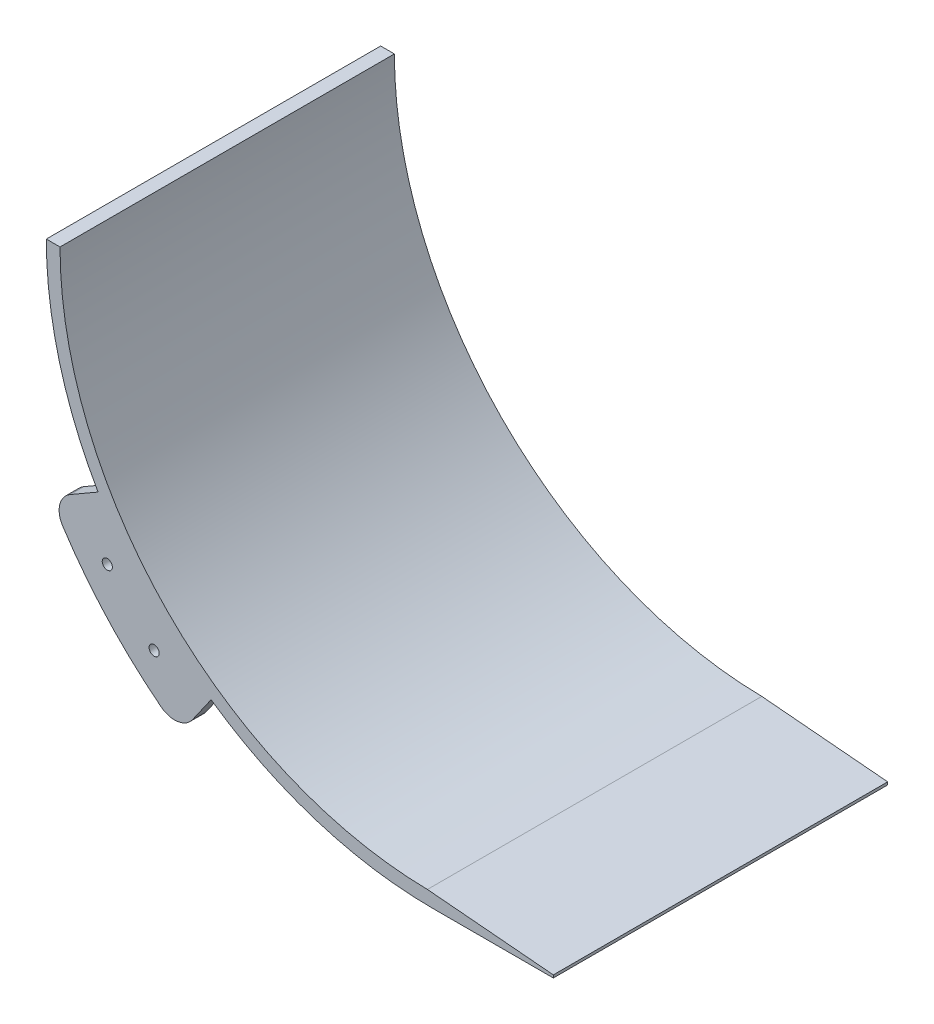
ISO-10303-21;
HEADER;
FILE_DESCRIPTION(('STEP AP214'),'2;1');
FILE_NAME('part.step','',(''),(''),'','','');
FILE_SCHEMA(('AUTOMOTIVE_DESIGN { 1 0 10303 214 1 1 1 1 }'));
ENDSEC;
DATA;
#1=APPLICATION_CONTEXT('core data for automotive mechanical design processes');
#2=APPLICATION_PROTOCOL_DEFINITION('international standard','automotive_design',2000,#1);
#3=PRODUCT_CONTEXT('',#1,'mechanical');
#4=PRODUCT('Part','Part','',(#3));
#5=PRODUCT_RELATED_PRODUCT_CATEGORY('part','',(#4));
#6=PRODUCT_DEFINITION_FORMATION('','',#4);
#7=PRODUCT_DEFINITION_CONTEXT('part definition',#1,'design');
#8=PRODUCT_DEFINITION('design','',#6,#7);
#9=PRODUCT_DEFINITION_SHAPE('','',#8);
#10=(LENGTH_UNIT() NAMED_UNIT(*) SI_UNIT(.MILLI.,.METRE.));
#11=(NAMED_UNIT(*) PLANE_ANGLE_UNIT() SI_UNIT($,.RADIAN.));
#12=(NAMED_UNIT(*) SI_UNIT($,.STERADIAN.) SOLID_ANGLE_UNIT());
#13=UNCERTAINTY_MEASURE_WITH_UNIT(LENGTH_MEASURE(1.E-05),#10,'distance_accuracy_value','');
#14=(GEOMETRIC_REPRESENTATION_CONTEXT(3) GLOBAL_UNCERTAINTY_ASSIGNED_CONTEXT((#13)) GLOBAL_UNIT_ASSIGNED_CONTEXT((#10,
#11,#12)) REPRESENTATION_CONTEXT('',''));
#15=CARTESIAN_POINT('',(0.,0.,0.));
#16=DIRECTION('',(0.,0.,1.));
#17=DIRECTION('',(1.,0.,0.));
#18=AXIS2_PLACEMENT_3D('',#15,#16,#17);
#19=CARTESIAN_POINT('',(0.,0.,77.47));
#20=DIRECTION('',(0.,0.,-1.));
#21=DIRECTION('',(-1.,0.,0.));
#22=AXIS2_PLACEMENT_3D('',#19,#20,#21);
#23=CYLINDRICAL_SURFACE('',#22,179.07);
#24=DIRECTION('',(0.,0.,-1.));
#25=VECTOR('',#24,1.);
#26=CARTESIAN_POINT('',(-155.079169055679,-89.5350000000006,-71.12));
#27=LINE('',#26,#25);
#28=CARTESIAN_POINT('',(-155.079169055679,-89.5350000000005,-71.12));
#29=VERTEX_POINT('',#28);
#30=CARTESIAN_POINT('',(-155.079169055679,-89.5350000000005,-77.47));
#31=VERTEX_POINT('',#30);
#32=EDGE_CURVE('E217',#29,#31,#27,.T.);
#33=ORIENTED_EDGE('',*,*,#32,.F.);
#34=CARTESIAN_POINT('',(0.,0.,-71.12));
#35=DIRECTION('',(0.,0.,-1.));
#36=DIRECTION('',(1.,0.,0.));
#37=AXIS2_PLACEMENT_3D('',#34,#35,#36);
#38=CIRCLE('',#37,179.07);
#39=CARTESIAN_POINT('',(-102.710332457383,-146.685556570829,-71.12));
#40=VERTEX_POINT('',#39);
#41=EDGE_CURVE('E197',#40,#29,#38,.T.);
#42=ORIENTED_EDGE('',*,*,#41,.F.);
#43=DIRECTION('',(0.,0.,-1.));
#44=VECTOR('',#43,1.);
#45=CARTESIAN_POINT('',(-102.710332457383,-146.685556570829,-71.12));
#46=LINE('',#45,#44);
#47=CARTESIAN_POINT('',(-102.710332457383,-146.685556570829,-77.47));
#48=VERTEX_POINT('',#47);
#49=EDGE_CURVE('E193',#40,#48,#46,.T.);
#50=ORIENTED_EDGE('',*,*,#49,.T.);
#51=CARTESIAN_POINT('',(0.,0.,-77.47));
#52=DIRECTION('',(0.,0.,1.));
#53=DIRECTION('',(1.,0.,0.));
#54=AXIS2_PLACEMENT_3D('',#51,#52,#53);
#55=CIRCLE('',#54,179.07);
#56=CARTESIAN_POINT('',(0.,-179.07,-77.47));
#57=VERTEX_POINT('',#56);
#58=EDGE_CURVE('E292',#48,#57,#55,.T.);
#59=ORIENTED_EDGE('',*,*,#58,.T.);
#60=DIRECTION('',(0.,0.,-1.));
#61=VECTOR('',#60,1.);
#62=CARTESIAN_POINT('',(0.,-179.07,77.47));
#63=LINE('',#62,#61);
#64=CARTESIAN_POINT('',(0.,-179.07,77.47));
#65=VERTEX_POINT('',#64);
#66=EDGE_CURVE('E300',#65,#57,#63,.T.);
#67=ORIENTED_EDGE('',*,*,#66,.F.);
#68=CARTESIAN_POINT('',(0.,0.,77.47));
#69=DIRECTION('',(0.,0.,1.));
#70=DIRECTION('',(1.,0.,0.));
#71=AXIS2_PLACEMENT_3D('',#68,#69,#70);
#72=CIRCLE('',#71,179.07);
#73=CARTESIAN_POINT('',(-102.710332457383,-146.685556570829,77.47));
#74=VERTEX_POINT('',#73);
#75=EDGE_CURVE('E280',#74,#65,#72,.T.);
#76=ORIENTED_EDGE('',*,*,#75,.F.);
#77=DIRECTION('',(0.,0.,1.));
#78=VECTOR('',#77,1.);
#79=CARTESIAN_POINT('',(-102.710332457383,-146.685556570829,71.12));
#80=LINE('',#79,#78);
#81=CARTESIAN_POINT('',(-102.710332457383,-146.685556570829,71.12));
#82=VERTEX_POINT('',#81);
#83=EDGE_CURVE('E261',#82,#74,#80,.T.);
#84=ORIENTED_EDGE('',*,*,#83,.F.);
#85=CARTESIAN_POINT('',(0.,0.,71.12));
#86=DIRECTION('',(0.,0.,-1.));
#87=DIRECTION('',(1.,0.,0.));
#88=AXIS2_PLACEMENT_3D('',#85,#86,#87);
#89=CIRCLE('',#88,179.07);
#90=CARTESIAN_POINT('',(-155.079169055679,-89.5350000000006,71.12));
#91=VERTEX_POINT('',#90);
#92=EDGE_CURVE('E229',#82,#91,#89,.T.);
#93=ORIENTED_EDGE('',*,*,#92,.T.);
#94=DIRECTION('',(0.,0.,1.));
#95=VECTOR('',#94,1.);
#96=CARTESIAN_POINT('',(-155.079169055679,-89.5350000000006,71.12));
#97=LINE('',#96,#95);
#98=CARTESIAN_POINT('',(-155.079169055679,-89.5350000000006,77.47));
#99=VERTEX_POINT('',#98);
#100=EDGE_CURVE('E248',#91,#99,#97,.T.);
#101=ORIENTED_EDGE('',*,*,#100,.T.);
#102=CARTESIAN_POINT('',(-179.07,5.81360062881976E-13,77.47));
#103=VERTEX_POINT('',#102);
#104=EDGE_CURVE('E281',#103,#99,#72,.T.);
#105=ORIENTED_EDGE('',*,*,#104,.F.);
#106=DIRECTION('',(0.,0.,-1.));
#107=VECTOR('',#106,1.);
#108=CARTESIAN_POINT('',(-179.07,5.81360062881976E-13,77.47));
#109=LINE('',#108,#107);
#110=CARTESIAN_POINT('',(-179.07,5.81360062881976E-13,-77.47));
#111=VERTEX_POINT('',#110);
#112=EDGE_CURVE('E303',#103,#111,#109,.T.);
#113=ORIENTED_EDGE('',*,*,#112,.T.);
#114=EDGE_CURVE('E293',#111,#31,#55,.T.);
#115=ORIENTED_EDGE('',*,*,#114,.T.);
#116=EDGE_LOOP('',(#33,#42,#50,#59,#67,#76,#84,#93,#101,#105,#113,#115));
#117=FACE_BOUND('',#116,.T.);
#118=ADVANCED_FACE('F45',(#117),#23,.T.);
#119=CARTESIAN_POINT('',(0.,0.,77.47));
#120=DIRECTION('',(0.,0.,-1.));
#121=DIRECTION('',(-1.,0.,0.));
#122=AXIS2_PLACEMENT_3D('',#119,#120,#121);
#123=CYLINDRICAL_SURFACE('',#122,172.72);
#124=CARTESIAN_POINT('',(0.,0.,77.47));
#125=DIRECTION('',(0.,0.,-1.));
#126=DIRECTION('',(1.,0.,0.));
#127=AXIS2_PLACEMENT_3D('',#124,#125,#126);
#128=CIRCLE('',#127,172.72);
#129=CARTESIAN_POINT('',(-2.46699722538356,-172.70238077308,77.47));
#130=VERTEX_POINT('',#129);
#131=CARTESIAN_POINT('',(-172.72,5.6074445781524E-13,77.47));
#132=VERTEX_POINT('',#131);
#133=EDGE_CURVE('E275',#130,#132,#128,.T.);
#134=ORIENTED_EDGE('',*,*,#133,.F.);
#135=DIRECTION('',(0.,0.,-1.));
#136=VECTOR('',#135,1.);
#137=CARTESIAN_POINT('',(-2.46699722538356,-172.70238077308,77.47));
#138=LINE('',#137,#136);
#139=CARTESIAN_POINT('',(-2.46699722538356,-172.70238077308,-77.47));
#140=VERTEX_POINT('',#139);
#141=EDGE_CURVE('E309',#130,#140,#138,.T.);
#142=ORIENTED_EDGE('',*,*,#141,.T.);
#143=CARTESIAN_POINT('',(0.,0.,-77.47));
#144=DIRECTION('',(0.,0.,-1.));
#145=DIRECTION('',(1.,0.,0.));
#146=AXIS2_PLACEMENT_3D('',#143,#144,#145);
#147=CIRCLE('',#146,172.72);
#148=CARTESIAN_POINT('',(-172.72,5.6074445781524E-13,-77.47));
#149=VERTEX_POINT('',#148);
#150=EDGE_CURVE('E264',#140,#149,#147,.T.);
#151=ORIENTED_EDGE('',*,*,#150,.T.);
#152=DIRECTION('',(0.,0.,-1.));
#153=VECTOR('',#152,1.);
#154=CARTESIAN_POINT('',(-172.72,5.6074445781524E-13,77.47));
#155=LINE('',#154,#153);
#156=EDGE_CURVE('E306',#132,#149,#155,.T.);
#157=ORIENTED_EDGE('',*,*,#156,.F.);
#158=EDGE_LOOP('',(#134,#142,#151,#157));
#159=FACE_BOUND('',#158,.T.);
#160=ADVANCED_FACE('F323',(#159),#123,.F.);
#161=CARTESIAN_POINT('',(-179.07,5.81360062881976E-13,77.47));
#162=DIRECTION('',(0.,-1.,0.));
#163=DIRECTION('',(1.,0.,0.));
#164=AXIS2_PLACEMENT_3D('',#161,#162,#163);
#165=PLANE('',#164);
#166=DIRECTION('',(-1.,0.,0.));
#167=VECTOR('',#166,1.);
#168=CARTESIAN_POINT('',(-179.07,5.81360062881976E-13,-77.47));
#169=LINE('',#168,#167);
#170=EDGE_CURVE('E290',#149,#111,#169,.T.);
#171=ORIENTED_EDGE('',*,*,#170,.T.);
#172=ORIENTED_EDGE('',*,*,#112,.F.);
#173=DIRECTION('',(-1.,0.,0.));
#174=VECTOR('',#173,1.);
#175=CARTESIAN_POINT('',(-179.07,5.81360062881976E-13,77.47));
#176=LINE('',#175,#174);
#177=EDGE_CURVE('E277',#132,#103,#176,.T.);
#178=ORIENTED_EDGE('',*,*,#177,.F.);
#179=ORIENTED_EDGE('',*,*,#156,.T.);
#180=EDGE_LOOP('',(#171,#172,#178,#179));
#181=FACE_BOUND('',#180,.T.);
#182=ADVANCED_FACE('F334',(#181),#165,.F.);
#183=CARTESIAN_POINT('',(55.8799999999989,-179.07,77.47));
#184=DIRECTION('',(0.,1.,0.));
#185=DIRECTION('',(0.,0.,1.));
#186=AXIS2_PLACEMENT_3D('',#183,#184,#185);
#187=PLANE('',#186);
#188=DIRECTION('',(1.,0.,0.));
#189=VECTOR('',#188,1.);
#190=CARTESIAN_POINT('',(55.8799999999989,-179.07,-77.47));
#191=LINE('',#190,#189);
#192=CARTESIAN_POINT('',(55.8799999999989,-179.07,-77.47));
#193=VERTEX_POINT('',#192);
#194=EDGE_CURVE('E295',#57,#193,#191,.T.);
#195=ORIENTED_EDGE('',*,*,#194,.T.);
#196=DIRECTION('',(0.,0.,-1.));
#197=VECTOR('',#196,1.);
#198=CARTESIAN_POINT('',(55.8799999999989,-179.07,77.47));
#199=LINE('',#198,#197);
#200=CARTESIAN_POINT('',(55.8799999999989,-179.07,77.47));
#201=VERTEX_POINT('',#200);
#202=EDGE_CURVE('E288',#201,#193,#199,.T.);
#203=ORIENTED_EDGE('',*,*,#202,.F.);
#204=DIRECTION('',(1.,0.,0.));
#205=VECTOR('',#204,1.);
#206=CARTESIAN_POINT('',(55.8799999999989,-179.07,77.47));
#207=LINE('',#206,#205);
#208=EDGE_CURVE('E284',#65,#201,#207,.T.);
#209=ORIENTED_EDGE('',*,*,#208,.F.);
#210=ORIENTED_EDGE('',*,*,#66,.T.);
#211=EDGE_LOOP('',(#195,#203,#209,#210));
#212=FACE_BOUND('',#211,.T.);
#213=ADVANCED_FACE('F358',(#212),#187,.F.);
#214=CARTESIAN_POINT('',(55.88,-172.72,77.47));
#215=DIRECTION('',(-1.,1.82487445976773E-13,0.));
#216=DIRECTION('',(-1.82487445976773E-13,-1.,0.));
#217=AXIS2_PLACEMENT_3D('',#214,#215,#216);
#218=PLANE('',#217);
#219=DIRECTION('',(1.82487445976773E-13,1.,0.));
#220=VECTOR('',#219,1.);
#221=CARTESIAN_POINT('',(55.88,-172.72,-77.47));
#222=LINE('',#221,#220);
#223=CARTESIAN_POINT('',(55.8799999999991,-177.812947112439,-77.47));
#224=VERTEX_POINT('',#223);
#225=EDGE_CURVE('E278',#193,#224,#222,.T.);
#226=ORIENTED_EDGE('',*,*,#225,.T.);
#227=DIRECTION('',(0.,0.,1.));
#228=VECTOR('',#227,1.);
#229=CARTESIAN_POINT('',(55.8799999999991,-177.812947112439,77.47));
#230=LINE('',#229,#228);
#231=CARTESIAN_POINT('',(55.8799999999991,-177.812947112439,77.47));
#232=VERTEX_POINT('',#231);
#233=EDGE_CURVE('E54',#224,#232,#230,.T.);
#234=ORIENTED_EDGE('',*,*,#233,.T.);
#235=DIRECTION('',(1.82487445976773E-13,1.,0.));
#236=VECTOR('',#235,1.);
#237=CARTESIAN_POINT('',(55.88,-172.72,77.47));
#238=LINE('',#237,#236);
#239=EDGE_CURVE('E286',#201,#232,#238,.T.);
#240=ORIENTED_EDGE('',*,*,#239,.F.);
#241=ORIENTED_EDGE('',*,*,#202,.T.);
#242=EDGE_LOOP('',(#226,#234,#240,#241));
#243=FACE_BOUND('',#242,.T.);
#244=ADVANCED_FACE('F364',(#243),#218,.F.);
#245=CARTESIAN_POINT('',(0.,0.,77.47));
#246=DIRECTION('',(0.,0.,1.));
#247=DIRECTION('',(1.,0.,0.));
#248=AXIS2_PLACEMENT_3D('',#245,#246,#247);
#249=PLANE('',#248);
#250=CARTESIAN_POINT('',(-150.804793507713,-116.396581801598,77.47));
#251=DIRECTION('',(0.,0.,1.));
#252=DIRECTION('',(1.,0.,0.));
#253=AXIS2_PLACEMENT_3D('',#250,#251,#252);
#254=CIRCLE('',#253,2.34950000000001);
#255=CARTESIAN_POINT('',(-148.455293507713,-116.396581801598,77.47));
#256=VERTEX_POINT('',#255);
#257=EDGE_CURVE('E436',#256,#256,#254,.T.);
#258=ORIENTED_EDGE('',*,*,#257,.F.);
#259=EDGE_LOOP('',(#258));
#260=FACE_BOUND('',#259,.T.);
#261=CARTESIAN_POINT('',(-129.097161454826,-140.086305198997,77.47));
#262=DIRECTION('',(0.,0.,1.));
#263=DIRECTION('',(1.,0.,0.));
#264=AXIS2_PLACEMENT_3D('',#261,#262,#263);
#265=CIRCLE('',#264,2.34950000000005);
#266=CARTESIAN_POINT('',(-126.747661454826,-140.086305198997,77.47));
#267=VERTEX_POINT('',#266);
#268=EDGE_CURVE('E433',#267,#267,#265,.T.);
#269=ORIENTED_EDGE('',*,*,#268,.F.);
#270=EDGE_LOOP('',(#269));
#271=FACE_BOUND('',#270,.T.);
#272=ORIENTED_EDGE('',*,*,#239,.T.);
#273=DIRECTION('',(0.996185998135626,-0.0872551266031199,0.));
#274=VECTOR('',#273,1.);
#275=CARTESIAN_POINT('',(-15.0304766413781,-171.601955763022,77.47));
#276=LINE('',#275,#274);
#277=EDGE_CURVE('E11',#232,#130,#276,.F.);
#278=ORIENTED_EDGE('',*,*,#277,.T.);
#279=ORIENTED_EDGE('',*,*,#133,.T.);
#280=ORIENTED_EDGE('',*,*,#177,.T.);
#281=ORIENTED_EDGE('',*,*,#104,.T.);
#282=DIRECTION('',(-0.866025403784438,-0.500000000000001,0.));
#283=VECTOR('',#282,1.);
#284=CARTESIAN_POINT('',(-155.079169055679,-89.5350000000006,77.47));
#285=LINE('',#284,#283);
#286=CARTESIAN_POINT('',(-168.047204305814,-97.0220986425263,77.47));
#287=VERTEX_POINT('',#286);
#288=EDGE_CURVE('E220',#99,#287,#285,.T.);
#289=ORIENTED_EDGE('',*,*,#288,.T.);
#290=CARTESIAN_POINT('',(-162.967204305814,-105.820916744976,77.47));
#291=DIRECTION('',(0.,0.,1.));
#292=DIRECTION('',(1.,0.,0.));
#293=AXIS2_PLACEMENT_3D('',#290,#291,#292);
#294=CIRCLE('',#293,10.16);
#295=CARTESIAN_POINT('',(-171.488365315268,-111.354036574779,77.47));
#296=VERTEX_POINT('',#295);
#297=EDGE_CURVE('E251',#287,#296,#294,.T.);
#298=ORIENTED_EDGE('',*,*,#297,.T.);
#299=CARTESIAN_POINT('',(0.,0.,77.47));
#300=DIRECTION('',(0.,0.,1.));
#301=DIRECTION('',(1.,0.,0.));
#302=AXIS2_PLACEMENT_3D('',#299,#300,#301);
#303=CIRCLE('',#302,204.47);
#304=CARTESIAN_POINT('',(-125.876496698544,-161.130656545865,77.47));
#305=VERTEX_POINT('',#304);
#306=EDGE_CURVE('E254',#296,#305,#303,.T.);
#307=ORIENTED_EDGE('',*,*,#306,.T.);
#308=CARTESIAN_POINT('',(-119.621763943336,-153.124164295139,77.47));
#309=DIRECTION('',(0.,0.,1.));
#310=DIRECTION('',(1.,0.,0.));
#311=AXIS2_PLACEMENT_3D('',#308,#309,#310);
#312=CIRCLE('',#311,10.1599999999998);
#313=CARTESIAN_POINT('',(-111.29917917336,-158.951700888466,77.47));
#314=VERTEX_POINT('',#313);
#315=EDGE_CURVE('E257',#305,#314,#312,.T.);
#316=ORIENTED_EDGE('',*,*,#315,.T.);
#317=DIRECTION('',(0.573576436351051,0.819152044288988,0.));
#318=VECTOR('',#317,1.);
#319=CARTESIAN_POINT('',(-111.29917917336,-158.951700888466,77.47));
#320=LINE('',#319,#318);
#321=EDGE_CURVE('E233',#314,#74,#320,.T.);
#322=ORIENTED_EDGE('',*,*,#321,.T.);
#323=ORIENTED_EDGE('',*,*,#75,.T.);
#324=ORIENTED_EDGE('',*,*,#208,.T.);
#325=EDGE_LOOP('',(#272,#278,#279,#280,#281,#289,#298,#307,#316,#322,#323,#324));
#326=FACE_BOUND('',#325,.T.);
#327=ADVANCED_FACE('F337',(#260,#271,#326),#249,.T.);
#328=CARTESIAN_POINT('',(0.,0.,-77.47));
#329=DIRECTION('',(0.,0.,1.));
#330=DIRECTION('',(1.,0.,0.));
#331=AXIS2_PLACEMENT_3D('',#328,#329,#330);
#332=PLANE('',#331);
#333=CARTESIAN_POINT('',(-150.804793507713,-116.396581801598,-77.47));
#334=DIRECTION('',(0.,0.,1.));
#335=DIRECTION('',(1.,0.,0.));
#336=AXIS2_PLACEMENT_3D('',#333,#334,#335);
#337=CIRCLE('',#336,2.34950000000001);
#338=CARTESIAN_POINT('',(-148.455293507713,-116.396581801598,-77.47));
#339=VERTEX_POINT('',#338);
#340=EDGE_CURVE('E314',#339,#339,#337,.T.);
#341=ORIENTED_EDGE('',*,*,#340,.T.);
#342=EDGE_LOOP('',(#341));
#343=FACE_BOUND('',#342,.T.);
#344=CARTESIAN_POINT('',(-129.097161454826,-140.086305198997,-77.47));
#345=DIRECTION('',(0.,0.,1.));
#346=DIRECTION('',(1.,0.,0.));
#347=AXIS2_PLACEMENT_3D('',#344,#345,#346);
#348=CIRCLE('',#347,2.34950000000005);
#349=CARTESIAN_POINT('',(-126.747661454826,-140.086305198997,-77.47));
#350=VERTEX_POINT('',#349);
#351=EDGE_CURVE('E431',#350,#350,#348,.T.);
#352=ORIENTED_EDGE('',*,*,#351,.T.);
#353=EDGE_LOOP('',(#352));
#354=FACE_BOUND('',#353,.T.);
#355=ORIENTED_EDGE('',*,*,#150,.F.);
#356=DIRECTION('',(-0.996185998135626,0.0872551266031199,0.));
#357=VECTOR('',#356,1.);
#358=CARTESIAN_POINT('',(-2.46699722538351,-172.70238077308,-77.47));
#359=LINE('',#358,#357);
#360=EDGE_CURVE('E68',#140,#224,#359,.F.);
#361=ORIENTED_EDGE('',*,*,#360,.T.);
#362=ORIENTED_EDGE('',*,*,#225,.F.);
#363=ORIENTED_EDGE('',*,*,#194,.F.);
#364=ORIENTED_EDGE('',*,*,#58,.F.);
#365=DIRECTION('',(0.573576436351051,0.819152044288988,0.));
#366=VECTOR('',#365,1.);
#367=CARTESIAN_POINT('',(-111.29917917336,-158.951700888466,-77.47));
#368=LINE('',#367,#366);
#369=CARTESIAN_POINT('',(-111.29917917336,-158.951700888466,-77.47));
#370=VERTEX_POINT('',#369);
#371=EDGE_CURVE('E208',#370,#48,#368,.T.);
#372=ORIENTED_EDGE('',*,*,#371,.F.);
#373=CARTESIAN_POINT('',(-119.621763943336,-153.124164295139,-77.47));
#374=DIRECTION('',(0.,0.,1.));
#375=DIRECTION('',(1.,0.,0.));
#376=AXIS2_PLACEMENT_3D('',#373,#374,#375);
#377=CIRCLE('',#376,10.1599999999998);
#378=CARTESIAN_POINT('',(-125.876496698544,-161.130656545865,-77.47));
#379=VERTEX_POINT('',#378);
#380=EDGE_CURVE('E188',#379,#370,#377,.T.);
#381=ORIENTED_EDGE('',*,*,#380,.F.);
#382=CARTESIAN_POINT('',(0.,0.,-77.47));
#383=DIRECTION('',(0.,0.,1.));
#384=DIRECTION('',(1.,0.,0.));
#385=AXIS2_PLACEMENT_3D('',#382,#383,#384);
#386=CIRCLE('',#385,204.47);
#387=CARTESIAN_POINT('',(-171.488365315268,-111.354036574779,-77.47));
#388=VERTEX_POINT('',#387);
#389=EDGE_CURVE('E212',#388,#379,#386,.T.);
#390=ORIENTED_EDGE('',*,*,#389,.F.);
#391=CARTESIAN_POINT('',(-162.967204305814,-105.820916744976,-77.47));
#392=DIRECTION('',(0.,0.,1.));
#393=DIRECTION('',(1.,0.,0.));
#394=AXIS2_PLACEMENT_3D('',#391,#392,#393);
#395=CIRCLE('',#394,10.16);
#396=CARTESIAN_POINT('',(-168.047204305814,-97.0220986425263,-77.47));
#397=VERTEX_POINT('',#396);
#398=EDGE_CURVE('E214',#397,#388,#395,.T.);
#399=ORIENTED_EDGE('',*,*,#398,.F.);
#400=DIRECTION('',(-0.866025403784438,-0.500000000000001,0.));
#401=VECTOR('',#400,1.);
#402=CARTESIAN_POINT('',(-155.079169055679,-89.5350000000006,-77.47));
#403=LINE('',#402,#401);
#404=EDGE_CURVE('E199',#31,#397,#403,.T.);
#405=ORIENTED_EDGE('',*,*,#404,.F.);
#406=ORIENTED_EDGE('',*,*,#114,.F.);
#407=ORIENTED_EDGE('',*,*,#170,.F.);
#408=EDGE_LOOP('',(#355,#361,#362,#363,#364,#372,#381,#390,#399,#405,#406,#407));
#409=FACE_BOUND('',#408,.T.);
#410=ADVANCED_FACE('F328',(#343,#354,#409),#332,.F.);
#411=CARTESIAN_POINT('',(-111.29917917336,-158.951700888466,71.12));
#412=DIRECTION('',(0.819152044288988,-0.573576436351051,0.));
#413=DIRECTION('',(0.573576436351051,0.819152044288988,0.));
#414=AXIS2_PLACEMENT_3D('',#411,#412,#413);
#415=PLANE('',#414);
#416=ORIENTED_EDGE('',*,*,#321,.F.);
#417=DIRECTION('',(0.,0.,1.));
#418=VECTOR('',#417,1.);
#419=CARTESIAN_POINT('',(-111.29917917336,-158.951700888466,71.12));
#420=LINE('',#419,#418);
#421=CARTESIAN_POINT('',(-111.29917917336,-158.951700888466,71.12));
#422=VERTEX_POINT('',#421);
#423=EDGE_CURVE('E265',#422,#314,#420,.T.);
#424=ORIENTED_EDGE('',*,*,#423,.F.);
#425=DIRECTION('',(0.573576436351051,0.819152044288988,0.));
#426=VECTOR('',#425,1.);
#427=CARTESIAN_POINT('',(-111.29917917336,-158.951700888466,71.12));
#428=LINE('',#427,#426);
#429=EDGE_CURVE('E245',#422,#82,#428,.T.);
#430=ORIENTED_EDGE('',*,*,#429,.T.);
#431=ORIENTED_EDGE('',*,*,#83,.T.);
#432=EDGE_LOOP('',(#416,#424,#430,#431));
#433=FACE_BOUND('',#432,.T.);
#434=ADVANCED_FACE('F403',(#433),#415,.T.);
#435=CARTESIAN_POINT('',(-119.621763943336,-153.124164295139,71.12));
#436=DIRECTION('',(0.,0.,1.));
#437=DIRECTION('',(1.,0.,0.));
#438=AXIS2_PLACEMENT_3D('',#435,#436,#437);
#439=CYLINDRICAL_SURFACE('',#438,10.1599999999998);
#440=ORIENTED_EDGE('',*,*,#315,.F.);
#441=DIRECTION('',(0.,0.,1.));
#442=VECTOR('',#441,1.);
#443=CARTESIAN_POINT('',(-125.876496698544,-161.130656545865,71.12));
#444=LINE('',#443,#442);
#445=CARTESIAN_POINT('',(-125.876496698544,-161.130656545865,71.12));
#446=VERTEX_POINT('',#445);
#447=EDGE_CURVE('E267',#446,#305,#444,.T.);
#448=ORIENTED_EDGE('',*,*,#447,.F.);
#449=CARTESIAN_POINT('',(-119.621763943336,-153.124164295139,71.12));
#450=DIRECTION('',(0.,0.,1.));
#451=DIRECTION('',(1.,0.,0.));
#452=AXIS2_PLACEMENT_3D('',#449,#450,#451);
#453=CIRCLE('',#452,10.1599999999998);
#454=EDGE_CURVE('E242',#446,#422,#453,.T.);
#455=ORIENTED_EDGE('',*,*,#454,.T.);
#456=ORIENTED_EDGE('',*,*,#423,.T.);
#457=EDGE_LOOP('',(#440,#448,#455,#456));
#458=FACE_BOUND('',#457,.T.);
#459=ADVANCED_FACE('F405',(#458),#439,.T.);
#460=CARTESIAN_POINT('',(0.,0.,71.12));
#461=DIRECTION('',(0.,0.,1.));
#462=DIRECTION('',(1.,0.,0.));
#463=AXIS2_PLACEMENT_3D('',#460,#461,#462);
#464=CYLINDRICAL_SURFACE('',#463,204.47);
#465=ORIENTED_EDGE('',*,*,#306,.F.);
#466=DIRECTION('',(0.,0.,1.));
#467=VECTOR('',#466,1.);
#468=CARTESIAN_POINT('',(-171.488365315268,-111.354036574779,71.12));
#469=LINE('',#468,#467);
#470=CARTESIAN_POINT('',(-171.488365315268,-111.354036574779,71.12));
#471=VERTEX_POINT('',#470);
#472=EDGE_CURVE('E269',#471,#296,#469,.T.);
#473=ORIENTED_EDGE('',*,*,#472,.F.);
#474=CARTESIAN_POINT('',(0.,0.,71.12));
#475=DIRECTION('',(0.,0.,1.));
#476=DIRECTION('',(1.,0.,0.));
#477=AXIS2_PLACEMENT_3D('',#474,#475,#476);
#478=CIRCLE('',#477,204.47);
#479=EDGE_CURVE('E239',#471,#446,#478,.T.);
#480=ORIENTED_EDGE('',*,*,#479,.T.);
#481=ORIENTED_EDGE('',*,*,#447,.T.);
#482=EDGE_LOOP('',(#465,#473,#480,#481));
#483=FACE_BOUND('',#482,.T.);
#484=ADVANCED_FACE('F409',(#483),#464,.T.);
#485=CARTESIAN_POINT('',(-162.967204305814,-105.820916744976,71.12));
#486=DIRECTION('',(0.,0.,1.));
#487=DIRECTION('',(1.,0.,0.));
#488=AXIS2_PLACEMENT_3D('',#485,#486,#487);
#489=CYLINDRICAL_SURFACE('',#488,10.16);
#490=ORIENTED_EDGE('',*,*,#297,.F.);
#491=DIRECTION('',(0.,0.,1.));
#492=VECTOR('',#491,1.);
#493=CARTESIAN_POINT('',(-168.047204305814,-97.0220986425263,71.12));
#494=LINE('',#493,#492);
#495=CARTESIAN_POINT('',(-168.047204305814,-97.0220986425263,71.12));
#496=VERTEX_POINT('',#495);
#497=EDGE_CURVE('E271',#496,#287,#494,.T.);
#498=ORIENTED_EDGE('',*,*,#497,.F.);
#499=CARTESIAN_POINT('',(-162.967204305814,-105.820916744976,71.12));
#500=DIRECTION('',(0.,0.,1.));
#501=DIRECTION('',(1.,0.,0.));
#502=AXIS2_PLACEMENT_3D('',#499,#500,#501);
#503=CIRCLE('',#502,10.16);
#504=EDGE_CURVE('E236',#496,#471,#503,.T.);
#505=ORIENTED_EDGE('',*,*,#504,.T.);
#506=ORIENTED_EDGE('',*,*,#472,.T.);
#507=EDGE_LOOP('',(#490,#498,#505,#506));
#508=FACE_BOUND('',#507,.T.);
#509=ADVANCED_FACE('F413',(#508),#489,.T.);
#510=CARTESIAN_POINT('',(-155.079169055679,-89.5350000000006,71.12));
#511=DIRECTION('',(-0.500000000000001,0.866025403784438,0.));
#512=DIRECTION('',(-0.866025403784438,-0.500000000000002,0.));
#513=AXIS2_PLACEMENT_3D('',#510,#511,#512);
#514=PLANE('',#513);
#515=ORIENTED_EDGE('',*,*,#288,.F.);
#516=ORIENTED_EDGE('',*,*,#100,.F.);
#517=DIRECTION('',(-0.866025403784438,-0.500000000000001,0.));
#518=VECTOR('',#517,1.);
#519=CARTESIAN_POINT('',(-155.079169055679,-89.5350000000006,71.12));
#520=LINE('',#519,#518);
#521=EDGE_CURVE('E232',#91,#496,#520,.T.);
#522=ORIENTED_EDGE('',*,*,#521,.T.);
#523=ORIENTED_EDGE('',*,*,#497,.T.);
#524=EDGE_LOOP('',(#515,#516,#522,#523));
#525=FACE_BOUND('',#524,.T.);
#526=ADVANCED_FACE('F401',(#525),#514,.T.);
#527=CARTESIAN_POINT('',(0.,0.,71.12));
#528=DIRECTION('',(0.,0.,1.));
#529=DIRECTION('',(1.,0.,0.));
#530=AXIS2_PLACEMENT_3D('',#527,#528,#529);
#531=PLANE('',#530);
#532=CARTESIAN_POINT('',(-150.804793507713,-116.396581801598,71.12));
#533=DIRECTION('',(0.,0.,1.));
#534=DIRECTION('',(1.,0.,0.));
#535=AXIS2_PLACEMENT_3D('',#532,#533,#534);
#536=CIRCLE('',#535,2.34950000000001);
#537=CARTESIAN_POINT('',(-148.455293507713,-116.396581801598,71.12));
#538=VERTEX_POINT('',#537);
#539=EDGE_CURVE('E210',#538,#538,#536,.T.);
#540=ORIENTED_EDGE('',*,*,#539,.T.);
#541=EDGE_LOOP('',(#540));
#542=FACE_BOUND('',#541,.T.);
#543=CARTESIAN_POINT('',(-129.097161454826,-140.086305198997,71.12));
#544=DIRECTION('',(0.,0.,1.));
#545=DIRECTION('',(1.,0.,0.));
#546=AXIS2_PLACEMENT_3D('',#543,#544,#545);
#547=CIRCLE('',#546,2.34950000000005);
#548=CARTESIAN_POINT('',(-126.747661454826,-140.086305198997,71.12));
#549=VERTEX_POINT('',#548);
#550=EDGE_CURVE('E313',#549,#549,#547,.T.);
#551=ORIENTED_EDGE('',*,*,#550,.T.);
#552=EDGE_LOOP('',(#551));
#553=FACE_BOUND('',#552,.T.);
#554=ORIENTED_EDGE('',*,*,#92,.F.);
#555=ORIENTED_EDGE('',*,*,#429,.F.);
#556=ORIENTED_EDGE('',*,*,#454,.F.);
#557=ORIENTED_EDGE('',*,*,#479,.F.);
#558=ORIENTED_EDGE('',*,*,#504,.F.);
#559=ORIENTED_EDGE('',*,*,#521,.F.);
#560=EDGE_LOOP('',(#554,#555,#556,#557,#558,#559));
#561=FACE_BOUND('',#560,.T.);
#562=ADVANCED_FACE('F398',(#542,#553,#561),#531,.F.);
#563=CARTESIAN_POINT('',(-155.079169055679,-89.5350000000006,-71.12));
#564=DIRECTION('',(0.500000000000001,-0.866025403784438,0.));
#565=DIRECTION('',(0.866025403784438,0.500000000000002,0.));
#566=AXIS2_PLACEMENT_3D('',#563,#564,#565);
#567=PLANE('',#566);
#568=ORIENTED_EDGE('',*,*,#404,.T.);
#569=DIRECTION('',(0.,0.,-1.));
#570=VECTOR('',#569,1.);
#571=CARTESIAN_POINT('',(-168.047204305814,-97.0220986425263,-71.12));
#572=LINE('',#571,#570);
#573=CARTESIAN_POINT('',(-168.047204305814,-97.0220986425263,-71.12));
#574=VERTEX_POINT('',#573);
#575=EDGE_CURVE('E221',#574,#397,#572,.T.);
#576=ORIENTED_EDGE('',*,*,#575,.F.);
#577=DIRECTION('',(-0.866025403784438,-0.500000000000001,0.));
#578=VECTOR('',#577,1.);
#579=CARTESIAN_POINT('',(-155.079169055679,-89.5350000000006,-71.12));
#580=LINE('',#579,#578);
#581=EDGE_CURVE('E206',#29,#574,#580,.T.);
#582=ORIENTED_EDGE('',*,*,#581,.F.);
#583=ORIENTED_EDGE('',*,*,#32,.T.);
#584=EDGE_LOOP('',(#568,#576,#582,#583));
#585=FACE_BOUND('',#584,.T.);
#586=ADVANCED_FACE('F379',(#585),#567,.F.);
#587=CARTESIAN_POINT('',(-162.967204305814,-105.820916744976,-71.12));
#588=DIRECTION('',(0.,0.,-1.));
#589=DIRECTION('',(-1.,0.,0.));
#590=AXIS2_PLACEMENT_3D('',#587,#588,#589);
#591=CYLINDRICAL_SURFACE('',#590,10.16);
#592=ORIENTED_EDGE('',*,*,#398,.T.);
#593=DIRECTION('',(0.,0.,-1.));
#594=VECTOR('',#593,1.);
#595=CARTESIAN_POINT('',(-171.488365315268,-111.354036574779,-71.12));
#596=LINE('',#595,#594);
#597=CARTESIAN_POINT('',(-171.488365315268,-111.354036574779,-71.12));
#598=VERTEX_POINT('',#597);
#599=EDGE_CURVE('E224',#598,#388,#596,.T.);
#600=ORIENTED_EDGE('',*,*,#599,.F.);
#601=CARTESIAN_POINT('',(-162.967204305814,-105.820916744976,-71.12));
#602=DIRECTION('',(0.,0.,1.));
#603=DIRECTION('',(1.,0.,0.));
#604=AXIS2_PLACEMENT_3D('',#601,#602,#603);
#605=CIRCLE('',#604,10.16);
#606=EDGE_CURVE('E204',#574,#598,#605,.T.);
#607=ORIENTED_EDGE('',*,*,#606,.F.);
#608=ORIENTED_EDGE('',*,*,#575,.T.);
#609=EDGE_LOOP('',(#592,#600,#607,#608));
#610=FACE_BOUND('',#609,.T.);
#611=ADVANCED_FACE('F382',(#610),#591,.T.);
#612=CARTESIAN_POINT('',(0.,0.,-71.12));
#613=DIRECTION('',(0.,0.,-1.));
#614=DIRECTION('',(-1.,0.,0.));
#615=AXIS2_PLACEMENT_3D('',#612,#613,#614);
#616=CYLINDRICAL_SURFACE('',#615,204.47);
#617=ORIENTED_EDGE('',*,*,#389,.T.);
#618=DIRECTION('',(0.,0.,-1.));
#619=VECTOR('',#618,1.);
#620=CARTESIAN_POINT('',(-125.876496698544,-161.130656545865,-71.12));
#621=LINE('',#620,#619);
#622=CARTESIAN_POINT('',(-125.876496698544,-161.130656545865,-71.12));
#623=VERTEX_POINT('',#622);
#624=EDGE_CURVE('E192',#623,#379,#621,.T.);
#625=ORIENTED_EDGE('',*,*,#624,.F.);
#626=CARTESIAN_POINT('',(0.,0.,-71.12));
#627=DIRECTION('',(0.,0.,1.));
#628=DIRECTION('',(1.,0.,0.));
#629=AXIS2_PLACEMENT_3D('',#626,#627,#628);
#630=CIRCLE('',#629,204.47);
#631=EDGE_CURVE('E179',#598,#623,#630,.T.);
#632=ORIENTED_EDGE('',*,*,#631,.F.);
#633=ORIENTED_EDGE('',*,*,#599,.T.);
#634=EDGE_LOOP('',(#617,#625,#632,#633));
#635=FACE_BOUND('',#634,.T.);
#636=ADVANCED_FACE('F385',(#635),#616,.T.);
#637=CARTESIAN_POINT('',(-119.621763943336,-153.124164295139,-71.12));
#638=DIRECTION('',(0.,0.,-1.));
#639=DIRECTION('',(-1.,0.,0.));
#640=AXIS2_PLACEMENT_3D('',#637,#638,#639);
#641=CYLINDRICAL_SURFACE('',#640,10.1599999999998);
#642=ORIENTED_EDGE('',*,*,#380,.T.);
#643=DIRECTION('',(0.,0.,-1.));
#644=VECTOR('',#643,1.);
#645=CARTESIAN_POINT('',(-111.29917917336,-158.951700888466,-71.12));
#646=LINE('',#645,#644);
#647=CARTESIAN_POINT('',(-111.29917917336,-158.951700888466,-71.12));
#648=VERTEX_POINT('',#647);
#649=EDGE_CURVE('E185',#648,#370,#646,.T.);
#650=ORIENTED_EDGE('',*,*,#649,.F.);
#651=CARTESIAN_POINT('',(-119.621763943336,-153.124164295139,-71.12));
#652=DIRECTION('',(0.,0.,1.));
#653=DIRECTION('',(1.,0.,0.));
#654=AXIS2_PLACEMENT_3D('',#651,#652,#653);
#655=CIRCLE('',#654,10.1599999999998);
#656=EDGE_CURVE('E171',#623,#648,#655,.T.);
#657=ORIENTED_EDGE('',*,*,#656,.F.);
#658=ORIENTED_EDGE('',*,*,#624,.T.);
#659=EDGE_LOOP('',(#642,#650,#657,#658));
#660=FACE_BOUND('',#659,.T.);
#661=ADVANCED_FACE('F186',(#660),#641,.T.);
#662=CARTESIAN_POINT('',(-111.29917917336,-158.951700888466,-71.12));
#663=DIRECTION('',(-0.819152044288988,0.573576436351051,0.));
#664=DIRECTION('',(-0.573576436351051,-0.819152044288988,0.));
#665=AXIS2_PLACEMENT_3D('',#662,#663,#664);
#666=PLANE('',#665);
#667=ORIENTED_EDGE('',*,*,#371,.T.);
#668=ORIENTED_EDGE('',*,*,#49,.F.);
#669=DIRECTION('',(0.573576436351051,0.819152044288988,0.));
#670=VECTOR('',#669,1.);
#671=CARTESIAN_POINT('',(-111.29917917336,-158.951700888466,-71.12));
#672=LINE('',#671,#670);
#673=EDGE_CURVE('E176',#648,#40,#672,.T.);
#674=ORIENTED_EDGE('',*,*,#673,.F.);
#675=ORIENTED_EDGE('',*,*,#649,.T.);
#676=EDGE_LOOP('',(#667,#668,#674,#675));
#677=FACE_BOUND('',#676,.T.);
#678=ADVANCED_FACE('F195',(#677),#666,.F.);
#679=CARTESIAN_POINT('',(0.,0.,-71.12));
#680=DIRECTION('',(0.,0.,-1.));
#681=DIRECTION('',(1.,0.,0.));
#682=AXIS2_PLACEMENT_3D('',#679,#680,#681);
#683=PLANE('',#682);
#684=CARTESIAN_POINT('',(-150.804793507713,-116.396581801598,-71.12));
#685=DIRECTION('',(0.,0.,-1.));
#686=DIRECTION('',(-1.,0.,0.));
#687=AXIS2_PLACEMENT_3D('',#684,#685,#686);
#688=CIRCLE('',#687,2.34950000000001);
#689=CARTESIAN_POINT('',(-153.154293507713,-116.396581801598,-71.12));
#690=VERTEX_POINT('',#689);
#691=EDGE_CURVE('E315',#690,#690,#688,.T.);
#692=ORIENTED_EDGE('',*,*,#691,.T.);
#693=EDGE_LOOP('',(#692));
#694=FACE_BOUND('',#693,.T.);
#695=CARTESIAN_POINT('',(-129.097161454826,-140.086305198997,-71.12));
#696=DIRECTION('',(0.,0.,-1.));
#697=DIRECTION('',(-1.,0.,0.));
#698=AXIS2_PLACEMENT_3D('',#695,#696,#697);
#699=CIRCLE('',#698,2.34950000000005);
#700=CARTESIAN_POINT('',(-131.446661454826,-140.086305198997,-71.12));
#701=VERTEX_POINT('',#700);
#702=EDGE_CURVE('E310',#701,#701,#699,.T.);
#703=ORIENTED_EDGE('',*,*,#702,.T.);
#704=EDGE_LOOP('',(#703));
#705=FACE_BOUND('',#704,.T.);
#706=ORIENTED_EDGE('',*,*,#41,.T.);
#707=ORIENTED_EDGE('',*,*,#581,.T.);
#708=ORIENTED_EDGE('',*,*,#606,.T.);
#709=ORIENTED_EDGE('',*,*,#631,.T.);
#710=ORIENTED_EDGE('',*,*,#656,.T.);
#711=ORIENTED_EDGE('',*,*,#673,.T.);
#712=EDGE_LOOP('',(#706,#707,#708,#709,#710,#711));
#713=FACE_BOUND('',#712,.T.);
#714=ADVANCED_FACE('F174',(#694,#705,#713),#683,.F.);
#715=CARTESIAN_POINT('',(-129.097161454826,-140.086305198997,-77.47));
#716=DIRECTION('',(0.,0.,1.));
#717=DIRECTION('',(1.,0.,0.));
#718=AXIS2_PLACEMENT_3D('',#715,#716,#717);
#719=CYLINDRICAL_SURFACE('',#718,2.34950000000005);
#720=ORIENTED_EDGE('',*,*,#351,.F.);
#721=EDGE_LOOP('',(#720));
#722=FACE_BOUND('',#721,.T.);
#723=ORIENTED_EDGE('',*,*,#702,.F.);
#724=EDGE_LOOP('',(#723));
#725=FACE_BOUND('',#724,.T.);
#726=ADVANCED_FACE('F462',(#722,#725),#719,.F.);
#727=CARTESIAN_POINT('',(-150.804793507713,-116.396581801598,-77.47));
#728=DIRECTION('',(0.,0.,1.));
#729=DIRECTION('',(1.,0.,0.));
#730=AXIS2_PLACEMENT_3D('',#727,#728,#729);
#731=CYLINDRICAL_SURFACE('',#730,2.34950000000001);
#732=ORIENTED_EDGE('',*,*,#340,.F.);
#733=EDGE_LOOP('',(#732));
#734=FACE_BOUND('',#733,.T.);
#735=ORIENTED_EDGE('',*,*,#691,.F.);
#736=EDGE_LOOP('',(#735));
#737=FACE_BOUND('',#736,.T.);
#738=ADVANCED_FACE('F347',(#734,#737),#731,.F.);
#739=ORIENTED_EDGE('',*,*,#268,.T.);
#740=EDGE_LOOP('',(#739));
#741=FACE_BOUND('',#740,.T.);
#742=ORIENTED_EDGE('',*,*,#550,.F.);
#743=EDGE_LOOP('',(#742));
#744=FACE_BOUND('',#743,.T.);
#745=ADVANCED_FACE('F344',(#741,#744),#719,.F.);
#746=ORIENTED_EDGE('',*,*,#257,.T.);
#747=EDGE_LOOP('',(#746));
#748=FACE_BOUND('',#747,.T.);
#749=ORIENTED_EDGE('',*,*,#539,.F.);
#750=EDGE_LOOP('',(#749));
#751=FACE_BOUND('',#750,.T.);
#752=ADVANCED_FACE('F339',(#748,#751),#731,.F.);
#753=CARTESIAN_POINT('',(-2.46699722538351,-172.70238077308,77.47));
#754=DIRECTION('',(-0.0872551266031199,-0.996185998135626,0.));
#755=DIRECTION('',(0.,0.,-1.));
#756=AXIS2_PLACEMENT_3D('',#753,#754,#755);
#757=PLANE('',#756);
#758=ORIENTED_EDGE('',*,*,#277,.F.);
#759=ORIENTED_EDGE('',*,*,#233,.F.);
#760=ORIENTED_EDGE('',*,*,#360,.F.);
#761=ORIENTED_EDGE('',*,*,#141,.F.);
#762=EDGE_LOOP('',(#758,#759,#760,#761));
#763=FACE_BOUND('',#762,.T.);
#764=ADVANCED_FACE('F48',(#763),#757,.F.);
#765=CLOSED_SHELL('',(#118,#160,#182,#213,#244,#327,#410,#434,#459,#484,#509,#526,#562,#586,
#611,#636,#661,#678,#714,#726,#738,#745,#752,#764));
#766=MANIFOLD_SOLID_BREP('B2',#765);
#767=ADVANCED_BREP_SHAPE_REPRESENTATION('',(#18,#766),#14);
#768=SHAPE_DEFINITION_REPRESENTATION(#9,#767);
ENDSEC;
END-ISO-10303-21;
